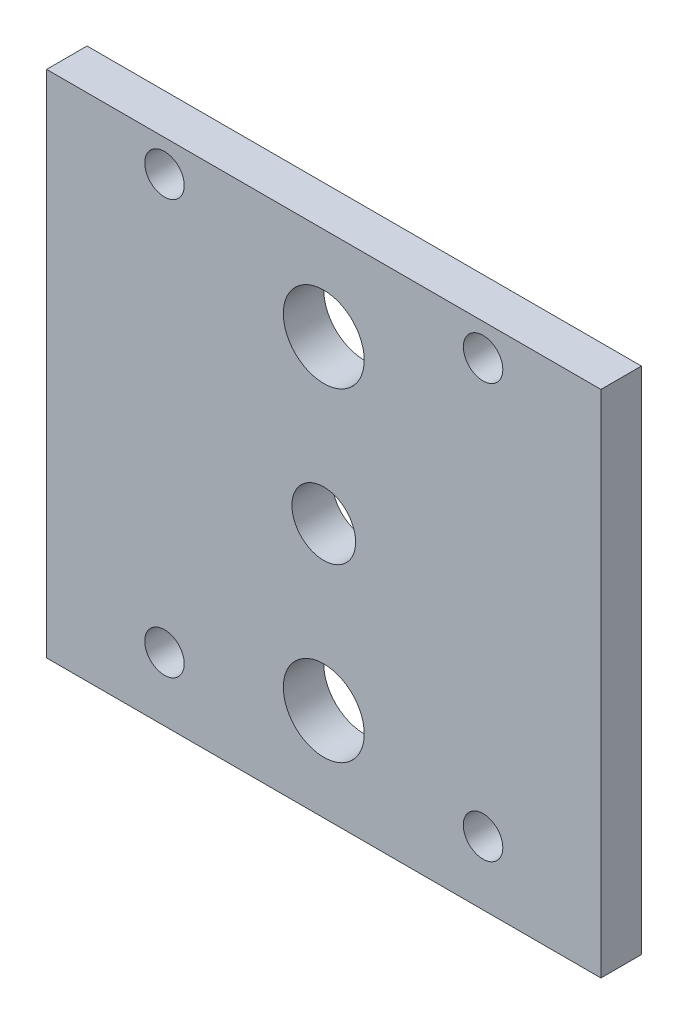
ISO-10303-21;
HEADER;
FILE_DESCRIPTION(('STEP AP214'),'2;1');
FILE_NAME('part.step','',(''),(''),'','','');
FILE_SCHEMA(('AUTOMOTIVE_DESIGN { 1 0 10303 214 1 1 1 1 }'));
ENDSEC;
DATA;
#1=APPLICATION_CONTEXT('core data for automotive mechanical design processes');
#2=APPLICATION_PROTOCOL_DEFINITION('international standard','automotive_design',2000,#1);
#3=PRODUCT_CONTEXT('',#1,'mechanical');
#4=PRODUCT('Part','Part','',(#3));
#5=PRODUCT_RELATED_PRODUCT_CATEGORY('part','',(#4));
#6=PRODUCT_DEFINITION_FORMATION('','',#4);
#7=PRODUCT_DEFINITION_CONTEXT('part definition',#1,'design');
#8=PRODUCT_DEFINITION('design','',#6,#7);
#9=PRODUCT_DEFINITION_SHAPE('','',#8);
#10=(LENGTH_UNIT() NAMED_UNIT(*) SI_UNIT(.MILLI.,.METRE.));
#11=(NAMED_UNIT(*) PLANE_ANGLE_UNIT() SI_UNIT($,.RADIAN.));
#12=(NAMED_UNIT(*) SI_UNIT($,.STERADIAN.) SOLID_ANGLE_UNIT());
#13=UNCERTAINTY_MEASURE_WITH_UNIT(LENGTH_MEASURE(1.E-05),#10,'distance_accuracy_value','');
#14=(GEOMETRIC_REPRESENTATION_CONTEXT(3) GLOBAL_UNCERTAINTY_ASSIGNED_CONTEXT((#13)) GLOBAL_UNIT_ASSIGNED_CONTEXT((#10,
#11,#12)) REPRESENTATION_CONTEXT('',''));
#15=CARTESIAN_POINT('',(0.,0.,0.));
#16=DIRECTION('',(0.,0.,1.));
#17=DIRECTION('',(1.,0.,0.));
#18=AXIS2_PLACEMENT_3D('',#15,#16,#17);
#19=CARTESIAN_POINT('',(0.,0.,6.35));
#20=DIRECTION('',(0.,0.,1.));
#21=DIRECTION('',(1.,0.,0.));
#22=AXIS2_PLACEMENT_3D('',#19,#20,#21);
#23=PLANE('',#22);
#24=CARTESIAN_POINT('',(25.,-30.,6.35));
#25=DIRECTION('',(0.,0.,1.));
#26=DIRECTION('',(1.,0.,0.));
#27=AXIS2_PLACEMENT_3D('',#24,#25,#26);
#28=CIRCLE('',#27,3.1);
#29=CARTESIAN_POINT('',(28.1,-30.,6.35));
#30=VERTEX_POINT('',#29);
#31=EDGE_CURVE('E141',#30,#30,#28,.T.);
#32=ORIENTED_EDGE('',*,*,#31,.F.);
#33=EDGE_LOOP('',(#32));
#34=FACE_BOUND('',#33,.T.);
#35=CARTESIAN_POINT('',(0.,-25.4,6.35));
#36=DIRECTION('',(0.,0.,1.));
#37=DIRECTION('',(1.,0.,0.));
#38=AXIS2_PLACEMENT_3D('',#35,#36,#37);
#39=CIRCLE('',#38,6.35);
#40=CARTESIAN_POINT('',(6.35000000000001,-25.4,6.35));
#41=VERTEX_POINT('',#40);
#42=EDGE_CURVE('E129',#41,#41,#39,.T.);
#43=ORIENTED_EDGE('',*,*,#42,.F.);
#44=EDGE_LOOP('',(#43));
#45=FACE_BOUND('',#44,.T.);
#46=CARTESIAN_POINT('',(25.,35.,6.35));
#47=DIRECTION('',(0.,0.,1.));
#48=DIRECTION('',(1.,0.,0.));
#49=AXIS2_PLACEMENT_3D('',#46,#47,#48);
#50=CIRCLE('',#49,3.1);
#51=CARTESIAN_POINT('',(28.1,35.,6.35));
#52=VERTEX_POINT('',#51);
#53=EDGE_CURVE('E117',#52,#52,#50,.T.);
#54=ORIENTED_EDGE('',*,*,#53,.F.);
#55=EDGE_LOOP('',(#54));
#56=FACE_BOUND('',#55,.T.);
#57=DIRECTION('',(0.,1.,0.));
#58=VECTOR('',#57,1.);
#59=CARTESIAN_POINT('',(43.5,40.,6.35));
#60=LINE('',#59,#58);
#61=CARTESIAN_POINT('',(43.5,-40.,6.35));
#62=VERTEX_POINT('',#61);
#63=CARTESIAN_POINT('',(43.5,40.,6.35));
#64=VERTEX_POINT('',#63);
#65=EDGE_CURVE('E87',#62,#64,#60,.T.);
#66=ORIENTED_EDGE('',*,*,#65,.T.);
#67=DIRECTION('',(-1.,0.,0.));
#68=VECTOR('',#67,1.);
#69=CARTESIAN_POINT('',(-43.5,40.,6.35));
#70=LINE('',#69,#68);
#71=CARTESIAN_POINT('',(-43.5,40.,6.35));
#72=VERTEX_POINT('',#71);
#73=EDGE_CURVE('E82',#64,#72,#70,.T.);
#74=ORIENTED_EDGE('',*,*,#73,.T.);
#75=DIRECTION('',(0.,-1.,0.));
#76=VECTOR('',#75,1.);
#77=CARTESIAN_POINT('',(-43.5,40.,6.35));
#78=LINE('',#77,#76);
#79=CARTESIAN_POINT('',(-43.5,-40.,6.35));
#80=VERTEX_POINT('',#79);
#81=EDGE_CURVE('E85',#72,#80,#78,.T.);
#82=ORIENTED_EDGE('',*,*,#81,.T.);
#83=DIRECTION('',(1.,0.,0.));
#84=VECTOR('',#83,1.);
#85=CARTESIAN_POINT('',(-43.5,-40.,6.35));
#86=LINE('',#85,#84);
#87=EDGE_CURVE('E52',#80,#62,#86,.T.);
#88=ORIENTED_EDGE('',*,*,#87,.T.);
#89=EDGE_LOOP('',(#66,#74,#82,#88));
#90=FACE_BOUND('',#89,.T.);
#91=CARTESIAN_POINT('',(-25.,35.,6.35));
#92=DIRECTION('',(0.,0.,1.));
#93=DIRECTION('',(1.,0.,0.));
#94=AXIS2_PLACEMENT_3D('',#91,#92,#93);
#95=CIRCLE('',#94,3.1);
#96=CARTESIAN_POINT('',(-21.9,35.,6.35));
#97=VERTEX_POINT('',#96);
#98=EDGE_CURVE('E102',#97,#97,#95,.T.);
#99=ORIENTED_EDGE('',*,*,#98,.F.);
#100=EDGE_LOOP('',(#99));
#101=FACE_BOUND('',#100,.T.);
#102=CARTESIAN_POINT('',(0.,25.4,6.35));
#103=DIRECTION('',(0.,0.,1.));
#104=DIRECTION('',(1.,0.,0.));
#105=AXIS2_PLACEMENT_3D('',#102,#103,#104);
#106=CIRCLE('',#105,6.35);
#107=CARTESIAN_POINT('',(6.35,25.4,6.35));
#108=VERTEX_POINT('',#107);
#109=EDGE_CURVE('E123',#108,#108,#106,.T.);
#110=ORIENTED_EDGE('',*,*,#109,.F.);
#111=EDGE_LOOP('',(#110));
#112=FACE_BOUND('',#111,.T.);
#113=CARTESIAN_POINT('',(-25.,-30.,6.35));
#114=DIRECTION('',(0.,0.,1.));
#115=DIRECTION('',(1.,0.,0.));
#116=AXIS2_PLACEMENT_3D('',#113,#114,#115);
#117=CIRCLE('',#116,3.1);
#118=CARTESIAN_POINT('',(-21.9,-30.,6.35));
#119=VERTEX_POINT('',#118);
#120=EDGE_CURVE('E135',#119,#119,#117,.T.);
#121=ORIENTED_EDGE('',*,*,#120,.F.);
#122=EDGE_LOOP('',(#121));
#123=FACE_BOUND('',#122,.T.);
#124=CARTESIAN_POINT('',(0.,0.,6.35));
#125=DIRECTION('',(0.,0.,1.));
#126=DIRECTION('',(1.,0.,0.));
#127=AXIS2_PLACEMENT_3D('',#124,#125,#126);
#128=CIRCLE('',#127,5.);
#129=CARTESIAN_POINT('',(4.99999999999999,0.,6.35));
#130=VERTEX_POINT('',#129);
#131=EDGE_CURVE('E147',#130,#130,#128,.T.);
#132=ORIENTED_EDGE('',*,*,#131,.F.);
#133=EDGE_LOOP('',(#132));
#134=FACE_BOUND('',#133,.T.);
#135=ADVANCED_FACE('F35',(#34,#45,#56,#90,#101,#112,#123,#134),#23,.T.);
#136=CARTESIAN_POINT('',(0.,0.,0.));
#137=DIRECTION('',(0.,0.,1.));
#138=DIRECTION('',(1.,0.,0.));
#139=AXIS2_PLACEMENT_3D('',#136,#137,#138);
#140=PLANE('',#139);
#141=DIRECTION('',(0.,1.,0.));
#142=VECTOR('',#141,1.);
#143=CARTESIAN_POINT('',(43.5,40.,0.));
#144=LINE('',#143,#142);
#145=CARTESIAN_POINT('',(43.5,-40.,0.));
#146=VERTEX_POINT('',#145);
#147=CARTESIAN_POINT('',(43.5,40.,0.));
#148=VERTEX_POINT('',#147);
#149=EDGE_CURVE('E99',#146,#148,#144,.T.);
#150=ORIENTED_EDGE('',*,*,#149,.F.);
#151=DIRECTION('',(1.,0.,0.));
#152=VECTOR('',#151,1.);
#153=CARTESIAN_POINT('',(-43.5,-40.,0.));
#154=LINE('',#153,#152);
#155=CARTESIAN_POINT('',(-43.5,-40.,0.));
#156=VERTEX_POINT('',#155);
#157=EDGE_CURVE('E75',#156,#146,#154,.T.);
#158=ORIENTED_EDGE('',*,*,#157,.F.);
#159=DIRECTION('',(0.,-1.,0.));
#160=VECTOR('',#159,1.);
#161=CARTESIAN_POINT('',(-43.5,40.,0.));
#162=LINE('',#161,#160);
#163=CARTESIAN_POINT('',(-43.5,40.,0.));
#164=VERTEX_POINT('',#163);
#165=EDGE_CURVE('E69',#164,#156,#162,.T.);
#166=ORIENTED_EDGE('',*,*,#165,.F.);
#167=DIRECTION('',(-1.,0.,0.));
#168=VECTOR('',#167,1.);
#169=CARTESIAN_POINT('',(-43.5,40.,0.));
#170=LINE('',#169,#168);
#171=EDGE_CURVE('E91',#148,#164,#170,.T.);
#172=ORIENTED_EDGE('',*,*,#171,.F.);
#173=EDGE_LOOP('',(#150,#158,#166,#172));
#174=FACE_BOUND('',#173,.T.);
#175=CARTESIAN_POINT('',(-25.,35.,0.));
#176=DIRECTION('',(0.,0.,1.));
#177=DIRECTION('',(1.,0.,0.));
#178=AXIS2_PLACEMENT_3D('',#175,#176,#177);
#179=CIRCLE('',#178,3.1);
#180=CARTESIAN_POINT('',(-21.9,35.,0.));
#181=VERTEX_POINT('',#180);
#182=EDGE_CURVE('E114',#181,#181,#179,.T.);
#183=ORIENTED_EDGE('',*,*,#182,.T.);
#184=EDGE_LOOP('',(#183));
#185=FACE_BOUND('',#184,.T.);
#186=CARTESIAN_POINT('',(25.,35.,0.));
#187=DIRECTION('',(0.,0.,1.));
#188=DIRECTION('',(1.,0.,0.));
#189=AXIS2_PLACEMENT_3D('',#186,#187,#188);
#190=CIRCLE('',#189,3.1);
#191=CARTESIAN_POINT('',(28.1,35.,0.));
#192=VERTEX_POINT('',#191);
#193=EDGE_CURVE('E120',#192,#192,#190,.T.);
#194=ORIENTED_EDGE('',*,*,#193,.T.);
#195=EDGE_LOOP('',(#194));
#196=FACE_BOUND('',#195,.T.);
#197=CARTESIAN_POINT('',(0.,25.4,0.));
#198=DIRECTION('',(0.,0.,1.));
#199=DIRECTION('',(1.,0.,0.));
#200=AXIS2_PLACEMENT_3D('',#197,#198,#199);
#201=CIRCLE('',#200,6.35);
#202=CARTESIAN_POINT('',(6.35,25.4,0.));
#203=VERTEX_POINT('',#202);
#204=EDGE_CURVE('E126',#203,#203,#201,.T.);
#205=ORIENTED_EDGE('',*,*,#204,.T.);
#206=EDGE_LOOP('',(#205));
#207=FACE_BOUND('',#206,.T.);
#208=CARTESIAN_POINT('',(0.,-25.4,0.));
#209=DIRECTION('',(0.,0.,1.));
#210=DIRECTION('',(1.,0.,0.));
#211=AXIS2_PLACEMENT_3D('',#208,#209,#210);
#212=CIRCLE('',#211,6.35);
#213=CARTESIAN_POINT('',(6.35000000000001,-25.4,0.));
#214=VERTEX_POINT('',#213);
#215=EDGE_CURVE('E132',#214,#214,#212,.T.);
#216=ORIENTED_EDGE('',*,*,#215,.T.);
#217=EDGE_LOOP('',(#216));
#218=FACE_BOUND('',#217,.T.);
#219=CARTESIAN_POINT('',(-25.,-30.,0.));
#220=DIRECTION('',(0.,0.,1.));
#221=DIRECTION('',(1.,0.,0.));
#222=AXIS2_PLACEMENT_3D('',#219,#220,#221);
#223=CIRCLE('',#222,3.1);
#224=CARTESIAN_POINT('',(-21.9,-30.,0.));
#225=VERTEX_POINT('',#224);
#226=EDGE_CURVE('E138',#225,#225,#223,.T.);
#227=ORIENTED_EDGE('',*,*,#226,.T.);
#228=EDGE_LOOP('',(#227));
#229=FACE_BOUND('',#228,.T.);
#230=CARTESIAN_POINT('',(25.,-30.,0.));
#231=DIRECTION('',(0.,0.,1.));
#232=DIRECTION('',(1.,0.,0.));
#233=AXIS2_PLACEMENT_3D('',#230,#231,#232);
#234=CIRCLE('',#233,3.1);
#235=CARTESIAN_POINT('',(28.1,-30.,0.));
#236=VERTEX_POINT('',#235);
#237=EDGE_CURVE('E144',#236,#236,#234,.T.);
#238=ORIENTED_EDGE('',*,*,#237,.T.);
#239=EDGE_LOOP('',(#238));
#240=FACE_BOUND('',#239,.T.);
#241=CARTESIAN_POINT('',(0.,0.,0.));
#242=DIRECTION('',(0.,0.,1.));
#243=DIRECTION('',(1.,0.,0.));
#244=AXIS2_PLACEMENT_3D('',#241,#242,#243);
#245=CIRCLE('',#244,5.);
#246=CARTESIAN_POINT('',(4.99999999999999,0.,0.));
#247=VERTEX_POINT('',#246);
#248=EDGE_CURVE('E150',#247,#247,#245,.T.);
#249=ORIENTED_EDGE('',*,*,#248,.T.);
#250=EDGE_LOOP('',(#249));
#251=FACE_BOUND('',#250,.T.);
#252=ADVANCED_FACE('F110',(#174,#185,#196,#207,#218,#229,#240,#251),#140,.F.);
#253=CARTESIAN_POINT('',(43.5,40.,6.35));
#254=DIRECTION('',(-1.,0.,0.));
#255=DIRECTION('',(0.,-1.,0.));
#256=AXIS2_PLACEMENT_3D('',#253,#254,#255);
#257=PLANE('',#256);
#258=ORIENTED_EDGE('',*,*,#149,.T.);
#259=DIRECTION('',(0.,0.,-1.));
#260=VECTOR('',#259,1.);
#261=CARTESIAN_POINT('',(43.5,40.,6.35));
#262=LINE('',#261,#260);
#263=EDGE_CURVE('E11',#64,#148,#262,.T.);
#264=ORIENTED_EDGE('',*,*,#263,.F.);
#265=ORIENTED_EDGE('',*,*,#65,.F.);
#266=DIRECTION('',(0.,0.,-1.));
#267=VECTOR('',#266,1.);
#268=CARTESIAN_POINT('',(43.5,-40.,6.35));
#269=LINE('',#268,#267);
#270=EDGE_CURVE('E95',#62,#146,#269,.T.);
#271=ORIENTED_EDGE('',*,*,#270,.T.);
#272=EDGE_LOOP('',(#258,#264,#265,#271));
#273=FACE_BOUND('',#272,.T.);
#274=ADVANCED_FACE('F37',(#273),#257,.F.);
#275=CARTESIAN_POINT('',(-43.5,40.,6.35));
#276=DIRECTION('',(0.,-1.,0.));
#277=DIRECTION('',(0.,0.,-1.));
#278=AXIS2_PLACEMENT_3D('',#275,#276,#277);
#279=PLANE('',#278);
#280=ORIENTED_EDGE('',*,*,#171,.T.);
#281=DIRECTION('',(0.,0.,-1.));
#282=VECTOR('',#281,1.);
#283=CARTESIAN_POINT('',(-43.5,40.,6.35));
#284=LINE('',#283,#282);
#285=EDGE_CURVE('E44',#72,#164,#284,.T.);
#286=ORIENTED_EDGE('',*,*,#285,.F.);
#287=ORIENTED_EDGE('',*,*,#73,.F.);
#288=ORIENTED_EDGE('',*,*,#263,.T.);
#289=EDGE_LOOP('',(#280,#286,#287,#288));
#290=FACE_BOUND('',#289,.T.);
#291=ADVANCED_FACE('F90',(#290),#279,.F.);
#292=CARTESIAN_POINT('',(-43.5,40.,6.35));
#293=DIRECTION('',(1.,0.,0.));
#294=DIRECTION('',(0.,1.,0.));
#295=AXIS2_PLACEMENT_3D('',#292,#293,#294);
#296=PLANE('',#295);
#297=ORIENTED_EDGE('',*,*,#165,.T.);
#298=DIRECTION('',(0.,0.,-1.));
#299=VECTOR('',#298,1.);
#300=CARTESIAN_POINT('',(-43.5,-40.,6.35));
#301=LINE('',#300,#299);
#302=EDGE_CURVE('E92',#80,#156,#301,.T.);
#303=ORIENTED_EDGE('',*,*,#302,.F.);
#304=ORIENTED_EDGE('',*,*,#81,.F.);
#305=ORIENTED_EDGE('',*,*,#285,.T.);
#306=EDGE_LOOP('',(#297,#303,#304,#305));
#307=FACE_BOUND('',#306,.T.);
#308=ADVANCED_FACE('F93',(#307),#296,.F.);
#309=CARTESIAN_POINT('',(-43.5,-40.,6.35));
#310=DIRECTION('',(0.,1.,0.));
#311=DIRECTION('',(0.,0.,1.));
#312=AXIS2_PLACEMENT_3D('',#309,#310,#311);
#313=PLANE('',#312);
#314=ORIENTED_EDGE('',*,*,#157,.T.);
#315=ORIENTED_EDGE('',*,*,#270,.F.);
#316=ORIENTED_EDGE('',*,*,#87,.F.);
#317=ORIENTED_EDGE('',*,*,#302,.T.);
#318=EDGE_LOOP('',(#314,#315,#316,#317));
#319=FACE_BOUND('',#318,.T.);
#320=ADVANCED_FACE('F107',(#319),#313,.F.);
#321=CARTESIAN_POINT('',(-25.,35.,6.35));
#322=DIRECTION('',(0.,0.,-1.));
#323=DIRECTION('',(-1.,0.,0.));
#324=AXIS2_PLACEMENT_3D('',#321,#322,#323);
#325=CYLINDRICAL_SURFACE('',#324,3.1);
#326=ORIENTED_EDGE('',*,*,#98,.T.);
#327=EDGE_LOOP('',(#326));
#328=FACE_BOUND('',#327,.T.);
#329=ORIENTED_EDGE('',*,*,#182,.F.);
#330=EDGE_LOOP('',(#329));
#331=FACE_BOUND('',#330,.T.);
#332=ADVANCED_FACE('F169',(#328,#331),#325,.F.);
#333=CARTESIAN_POINT('',(25.,35.,6.35));
#334=DIRECTION('',(0.,0.,-1.));
#335=DIRECTION('',(-1.,0.,0.));
#336=AXIS2_PLACEMENT_3D('',#333,#334,#335);
#337=CYLINDRICAL_SURFACE('',#336,3.1);
#338=ORIENTED_EDGE('',*,*,#53,.T.);
#339=EDGE_LOOP('',(#338));
#340=FACE_BOUND('',#339,.T.);
#341=ORIENTED_EDGE('',*,*,#193,.F.);
#342=EDGE_LOOP('',(#341));
#343=FACE_BOUND('',#342,.T.);
#344=ADVANCED_FACE('F215',(#340,#343),#337,.F.);
#345=CARTESIAN_POINT('',(0.,25.4,6.35));
#346=DIRECTION('',(0.,0.,-1.));
#347=DIRECTION('',(-1.,0.,0.));
#348=AXIS2_PLACEMENT_3D('',#345,#346,#347);
#349=CYLINDRICAL_SURFACE('',#348,6.35);
#350=ORIENTED_EDGE('',*,*,#109,.T.);
#351=EDGE_LOOP('',(#350));
#352=FACE_BOUND('',#351,.T.);
#353=ORIENTED_EDGE('',*,*,#204,.F.);
#354=EDGE_LOOP('',(#353));
#355=FACE_BOUND('',#354,.T.);
#356=ADVANCED_FACE('F223',(#352,#355),#349,.F.);
#357=CARTESIAN_POINT('',(0.,-25.4,6.35));
#358=DIRECTION('',(0.,0.,-1.));
#359=DIRECTION('',(-1.,0.,0.));
#360=AXIS2_PLACEMENT_3D('',#357,#358,#359);
#361=CYLINDRICAL_SURFACE('',#360,6.35);
#362=ORIENTED_EDGE('',*,*,#42,.T.);
#363=EDGE_LOOP('',(#362));
#364=FACE_BOUND('',#363,.T.);
#365=ORIENTED_EDGE('',*,*,#215,.F.);
#366=EDGE_LOOP('',(#365));
#367=FACE_BOUND('',#366,.T.);
#368=ADVANCED_FACE('F231',(#364,#367),#361,.F.);
#369=CARTESIAN_POINT('',(-25.,-30.,6.35));
#370=DIRECTION('',(0.,0.,-1.));
#371=DIRECTION('',(-1.,0.,0.));
#372=AXIS2_PLACEMENT_3D('',#369,#370,#371);
#373=CYLINDRICAL_SURFACE('',#372,3.1);
#374=ORIENTED_EDGE('',*,*,#120,.T.);
#375=EDGE_LOOP('',(#374));
#376=FACE_BOUND('',#375,.T.);
#377=ORIENTED_EDGE('',*,*,#226,.F.);
#378=EDGE_LOOP('',(#377));
#379=FACE_BOUND('',#378,.T.);
#380=ADVANCED_FACE('F240',(#376,#379),#373,.F.);
#381=CARTESIAN_POINT('',(25.,-30.,6.35));
#382=DIRECTION('',(0.,0.,-1.));
#383=DIRECTION('',(-1.,0.,0.));
#384=AXIS2_PLACEMENT_3D('',#381,#382,#383);
#385=CYLINDRICAL_SURFACE('',#384,3.1);
#386=ORIENTED_EDGE('',*,*,#31,.T.);
#387=EDGE_LOOP('',(#386));
#388=FACE_BOUND('',#387,.T.);
#389=ORIENTED_EDGE('',*,*,#237,.F.);
#390=EDGE_LOOP('',(#389));
#391=FACE_BOUND('',#390,.T.);
#392=ADVANCED_FACE('F249',(#388,#391),#385,.F.);
#393=CARTESIAN_POINT('',(0.,0.,6.35));
#394=DIRECTION('',(0.,0.,-1.));
#395=DIRECTION('',(-1.,0.,0.));
#396=AXIS2_PLACEMENT_3D('',#393,#394,#395);
#397=CYLINDRICAL_SURFACE('',#396,5.);
#398=ORIENTED_EDGE('',*,*,#131,.T.);
#399=EDGE_LOOP('',(#398));
#400=FACE_BOUND('',#399,.T.);
#401=ORIENTED_EDGE('',*,*,#248,.F.);
#402=EDGE_LOOP('',(#401));
#403=FACE_BOUND('',#402,.T.);
#404=ADVANCED_FACE('F156',(#400,#403),#397,.F.);
#405=CLOSED_SHELL('',(#135,#252,#274,#291,#308,#320,#332,#344,#356,#368,#380,#392,#404));
#406=MANIFOLD_SOLID_BREP('B2',#405);
#407=ADVANCED_BREP_SHAPE_REPRESENTATION('',(#18,#406),#14);
#408=SHAPE_DEFINITION_REPRESENTATION(#9,#407);
ENDSEC;
END-ISO-10303-21;
